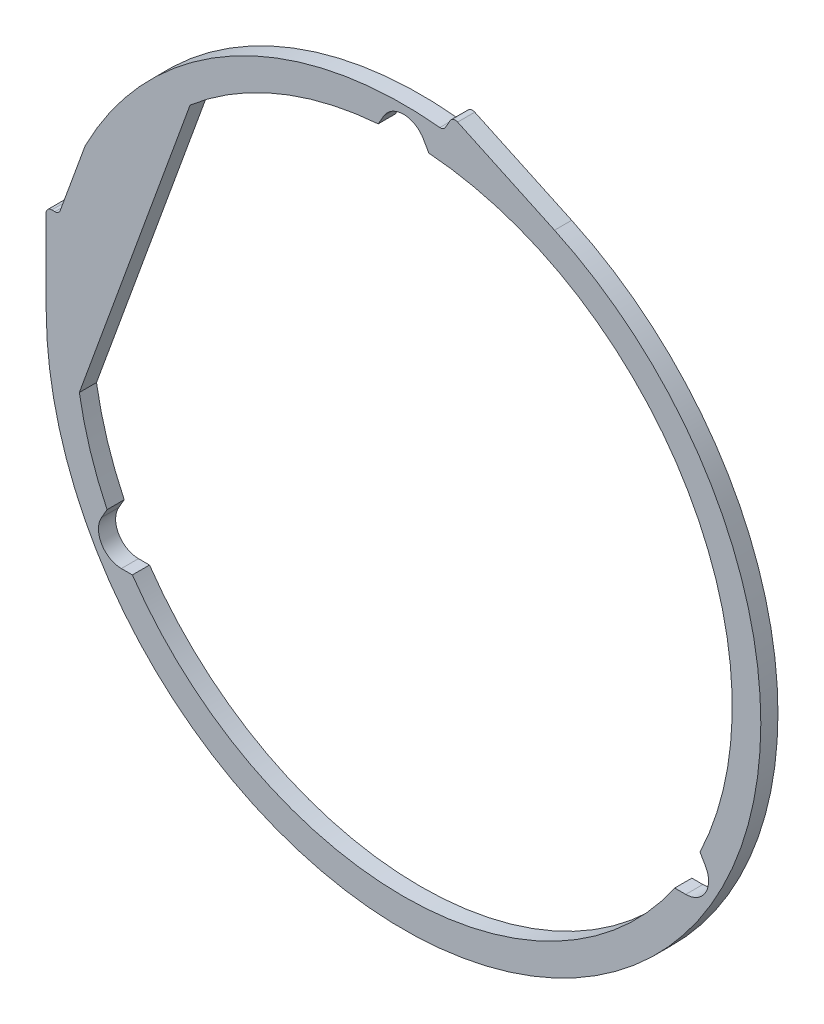
ISO-10303-21;
HEADER;
FILE_DESCRIPTION(('STEP AP214'),'2;1');
FILE_NAME('part.step','',(''),(''),'','','');
FILE_SCHEMA(('AUTOMOTIVE_DESIGN { 1 0 10303 214 1 1 1 1 }'));
ENDSEC;
DATA;
#1=APPLICATION_CONTEXT('core data for automotive mechanical design processes');
#2=APPLICATION_PROTOCOL_DEFINITION('international standard','automotive_design',2000,#1);
#3=PRODUCT_CONTEXT('',#1,'mechanical');
#4=PRODUCT('Part','Part','',(#3));
#5=PRODUCT_RELATED_PRODUCT_CATEGORY('part','',(#4));
#6=PRODUCT_DEFINITION_FORMATION('','',#4);
#7=PRODUCT_DEFINITION_CONTEXT('part definition',#1,'design');
#8=PRODUCT_DEFINITION('design','',#6,#7);
#9=PRODUCT_DEFINITION_SHAPE('','',#8);
#10=(LENGTH_UNIT() NAMED_UNIT(*) SI_UNIT(.MILLI.,.METRE.));
#11=(NAMED_UNIT(*) PLANE_ANGLE_UNIT() SI_UNIT($,.RADIAN.));
#12=(NAMED_UNIT(*) SI_UNIT($,.STERADIAN.) SOLID_ANGLE_UNIT());
#13=UNCERTAINTY_MEASURE_WITH_UNIT(LENGTH_MEASURE(1.E-05),#10,'distance_accuracy_value','');
#14=(GEOMETRIC_REPRESENTATION_CONTEXT(3) GLOBAL_UNCERTAINTY_ASSIGNED_CONTEXT((#13)) GLOBAL_UNIT_ASSIGNED_CONTEXT((#10,
#11,#12)) REPRESENTATION_CONTEXT('',''));
#15=CARTESIAN_POINT('',(0.,0.,0.));
#16=DIRECTION('',(0.,0.,1.));
#17=DIRECTION('',(1.,0.,0.));
#18=AXIS2_PLACEMENT_3D('',#15,#16,#17);
#19=CARTESIAN_POINT('',(0.,0.,-6.));
#20=DIRECTION('',(0.,0.,1.));
#21=DIRECTION('',(-1.,0.,0.));
#22=AXIS2_PLACEMENT_3D('',#19,#20,#21);
#23=CYLINDRICAL_SURFACE('',#22,115.);
#24=DIRECTION('',(0.,0.,1.));
#25=VECTOR('',#24,1.);
#26=CARTESIAN_POINT('',(8.85748634346278,114.658383625775,-6.));
#27=LINE('',#26,#25);
#28=CARTESIAN_POINT('',(8.8574863434628,114.658383625775,-6.));
#29=VERTEX_POINT('',#28);
#30=CARTESIAN_POINT('',(8.85748634346278,114.658383625775,0.));
#31=VERTEX_POINT('',#30);
#32=EDGE_CURVE('E398',#29,#31,#27,.T.);
#33=ORIENTED_EDGE('',*,*,#32,.F.);
#34=CARTESIAN_POINT('',(0.,0.,-6.));
#35=DIRECTION('',(0.,0.,1.));
#36=DIRECTION('',(-1.,0.,0.));
#37=AXIS2_PLACEMENT_3D('',#34,#35,#36);
#38=CIRCLE('',#37,115.);
#39=CARTESIAN_POINT('',(103.725816148514,-49.6583836257749,-6.));
#40=VERTEX_POINT('',#39);
#41=EDGE_CURVE('E553',#40,#29,#38,.T.);
#42=ORIENTED_EDGE('',*,*,#41,.F.);
#43=DIRECTION('',(0.,0.,1.));
#44=VECTOR('',#43,1.);
#45=CARTESIAN_POINT('',(103.725816148514,-49.6583836257749,-6.));
#46=LINE('',#45,#44);
#47=CARTESIAN_POINT('',(103.725816148514,-49.6583836257749,0.));
#48=VERTEX_POINT('',#47);
#49=EDGE_CURVE('E396',#48,#40,#46,.F.);
#50=ORIENTED_EDGE('',*,*,#49,.F.);
#51=CARTESIAN_POINT('',(0.,0.,0.));
#52=DIRECTION('',(0.,0.,1.));
#53=DIRECTION('',(-1.,0.,0.));
#54=AXIS2_PLACEMENT_3D('',#51,#52,#53);
#55=CIRCLE('',#54,115.);
#56=EDGE_CURVE('E558',#48,#31,#55,.T.);
#57=ORIENTED_EDGE('',*,*,#56,.T.);
#58=EDGE_LOOP('',(#33,#42,#50,#57));
#59=FACE_BOUND('',#58,.T.);
#60=ADVANCED_FACE('F36',(#59),#23,.F.);
#61=DIRECTION('',(0.,0.,1.));
#62=VECTOR('',#61,1.);
#63=CARTESIAN_POINT('',(94.8683298050514,-65.,-6.));
#64=LINE('',#63,#62);
#65=CARTESIAN_POINT('',(94.8683298050514,-65.,-6.));
#66=VERTEX_POINT('',#65);
#67=CARTESIAN_POINT('',(94.8683298050514,-65.,0.));
#68=VERTEX_POINT('',#67);
#69=EDGE_CURVE('E394',#66,#68,#64,.T.);
#70=ORIENTED_EDGE('',*,*,#69,.F.);
#71=CARTESIAN_POINT('',(-94.8683298050514,-65.0000000000001,-6.));
#72=VERTEX_POINT('',#71);
#73=EDGE_CURVE('E281',#72,#66,#38,.T.);
#74=ORIENTED_EDGE('',*,*,#73,.F.);
#75=DIRECTION('',(0.,0.,1.));
#76=VECTOR('',#75,1.);
#77=CARTESIAN_POINT('',(-94.8683298050514,-65.0000000000001,-6.));
#78=LINE('',#77,#76);
#79=CARTESIAN_POINT('',(-94.8683298050514,-65.0000000000001,0.));
#80=VERTEX_POINT('',#79);
#81=EDGE_CURVE('E392',#80,#72,#78,.F.);
#82=ORIENTED_EDGE('',*,*,#81,.F.);
#83=EDGE_CURVE('E288',#80,#68,#55,.T.);
#84=ORIENTED_EDGE('',*,*,#83,.T.);
#85=EDGE_LOOP('',(#70,#74,#82,#84));
#86=FACE_BOUND('',#85,.T.);
#87=ADVANCED_FACE('F434',(#86),#23,.F.);
#88=DIRECTION('',(0.,0.,1.));
#89=VECTOR('',#88,1.);
#90=CARTESIAN_POINT('',(-103.725816148514,-49.6583836257749,-6.));
#91=LINE('',#90,#89);
#92=CARTESIAN_POINT('',(-103.725816148514,-49.6583836257749,-6.));
#93=VERTEX_POINT('',#92);
#94=CARTESIAN_POINT('',(-103.725816148514,-49.6583836257749,0.));
#95=VERTEX_POINT('',#94);
#96=EDGE_CURVE('E390',#93,#95,#91,.T.);
#97=ORIENTED_EDGE('',*,*,#96,.F.);
#98=CARTESIAN_POINT('',(-113.419575030063,-19.,-6.));
#99=VERTEX_POINT('',#98);
#100=EDGE_CURVE('E277',#99,#93,#38,.T.);
#101=ORIENTED_EDGE('',*,*,#100,.F.);
#102=DIRECTION('',(0.,0.,1.));
#103=VECTOR('',#102,1.);
#104=CARTESIAN_POINT('',(-113.419575030063,-19.,-6.));
#105=LINE('',#104,#103);
#106=CARTESIAN_POINT('',(-113.419575030063,-19.,0.));
#107=VERTEX_POINT('',#106);
#108=EDGE_CURVE('E291',#99,#107,#105,.T.);
#109=ORIENTED_EDGE('',*,*,#108,.T.);
#110=EDGE_CURVE('E276',#107,#95,#55,.T.);
#111=ORIENTED_EDGE('',*,*,#110,.T.);
#112=EDGE_LOOP('',(#97,#101,#109,#111));
#113=FACE_BOUND('',#112,.T.);
#114=ADVANCED_FACE('F419',(#113),#23,.F.);
#115=CARTESIAN_POINT('',(0.,0.,-6.));
#116=DIRECTION('',(0.,0.,-1.));
#117=DIRECTION('',(1.,0.,0.));
#118=AXIS2_PLACEMENT_3D('',#115,#116,#117);
#119=PLANE('',#118);
#120=DIRECTION('',(-0.5,0.866025403784439,0.));
#121=VECTOR('',#120,1.);
#122=CARTESIAN_POINT('',(105.655099261702,-53.,-6.));
#123=LINE('',#122,#121);
#124=CARTESIAN_POINT('',(105.655099261702,-53.,-6.));
#125=VERTEX_POINT('',#124);
#126=EDGE_CURVE('E221',#125,#40,#123,.T.);
#127=ORIENTED_EDGE('',*,*,#126,.T.);
#128=ORIENTED_EDGE('',*,*,#41,.T.);
#129=CARTESIAN_POINT('',(6.9282032302755,118.,-6.));
#130=VERTEX_POINT('',#129);
#131=EDGE_CURVE('E236',#29,#130,#123,.T.);
#132=ORIENTED_EDGE('',*,*,#131,.T.);
#133=CARTESIAN_POINT('',(0.,114.,-6.));
#134=DIRECTION('',(0.,0.,1.));
#135=DIRECTION('',(1.,0.,0.));
#136=AXIS2_PLACEMENT_3D('',#133,#134,#135);
#137=CIRCLE('',#136,8.);
#138=CARTESIAN_POINT('',(-6.92820323027552,118.,-6.));
#139=VERTEX_POINT('',#138);
#140=EDGE_CURVE('E214',#130,#139,#137,.T.);
#141=ORIENTED_EDGE('',*,*,#140,.T.);
#142=DIRECTION('',(-0.5,-0.866025403784439,0.));
#143=VECTOR('',#142,1.);
#144=CARTESIAN_POINT('',(-6.92820323027552,118.,-6.));
#145=LINE('',#144,#143);
#146=CARTESIAN_POINT('',(-8.85748634346283,114.658383625775,-6.));
#147=VERTEX_POINT('',#146);
#148=EDGE_CURVE('E224',#139,#147,#145,.T.);
#149=ORIENTED_EDGE('',*,*,#148,.T.);
#150=CARTESIAN_POINT('',(-74.6714706086505,87.4595419444982,-6.));
#151=VERTEX_POINT('',#150);
#152=EDGE_CURVE('E275',#147,#151,#38,.T.);
#153=ORIENTED_EDGE('',*,*,#152,.T.);
#154=DIRECTION('',(-0.342020143325672,-0.939692620785907,0.));
#155=VECTOR('',#154,1.);
#156=CARTESIAN_POINT('',(-83.9036139442699,62.0944365967156,-6.));
#157=LINE('',#156,#155);
#158=EDGE_CURVE('E272',#151,#99,#157,.T.);
#159=ORIENTED_EDGE('',*,*,#158,.T.);
#160=ORIENTED_EDGE('',*,*,#100,.T.);
#161=CARTESIAN_POINT('',(-105.655099261702,-53.0000000000001,-6.));
#162=VERTEX_POINT('',#161);
#163=EDGE_CURVE('E59',#93,#162,#145,.T.);
#164=ORIENTED_EDGE('',*,*,#163,.T.);
#165=CARTESIAN_POINT('',(-98.7268960314261,-57.0000000000001,-6.));
#166=DIRECTION('',(0.,0.,1.));
#167=DIRECTION('',(-1.,0.,0.));
#168=AXIS2_PLACEMENT_3D('',#165,#166,#167);
#169=CIRCLE('',#168,7.99999999999999);
#170=CARTESIAN_POINT('',(-98.7268960314261,-65.0000000000001,-6.));
#171=VERTEX_POINT('',#170);
#172=EDGE_CURVE('E230',#162,#171,#169,.T.);
#173=ORIENTED_EDGE('',*,*,#172,.T.);
#174=DIRECTION('',(1.,0.,0.));
#175=VECTOR('',#174,1.);
#176=CARTESIAN_POINT('',(-98.7268960314261,-65.0000000000001,-6.));
#177=LINE('',#176,#175);
#178=EDGE_CURVE('E241',#171,#72,#177,.T.);
#179=ORIENTED_EDGE('',*,*,#178,.T.);
#180=ORIENTED_EDGE('',*,*,#73,.T.);
#181=CARTESIAN_POINT('',(98.726896031426,-65.,-6.));
#182=VERTEX_POINT('',#181);
#183=EDGE_CURVE('E51',#66,#182,#177,.T.);
#184=ORIENTED_EDGE('',*,*,#183,.T.);
#185=CARTESIAN_POINT('',(98.726896031426,-57.,-6.));
#186=DIRECTION('',(0.,0.,1.));
#187=DIRECTION('',(1.,0.,0.));
#188=AXIS2_PLACEMENT_3D('',#185,#186,#187);
#189=CIRCLE('',#188,8.00000000000001);
#190=EDGE_CURVE('E244',#182,#125,#189,.T.);
#191=ORIENTED_EDGE('',*,*,#190,.T.);
#192=EDGE_LOOP('',(#127,#128,#132,#141,#149,#153,#159,#160,#164,#173,#179,#180,#184,#191));
#193=FACE_BOUND('',#192,.T.);
#194=CARTESIAN_POINT('',(0.,0.,-6.));
#195=DIRECTION('',(0.,0.,1.));
#196=DIRECTION('',(1.,0.,0.));
#197=AXIS2_PLACEMENT_3D('',#194,#195,#196);
#198=CIRCLE('',#197,125.);
#199=CARTESIAN_POINT('',(12.7155638171814,124.351575932158,-6.));
#200=VERTEX_POINT('',#199);
#201=CARTESIAN_POINT('',(-111.368165093256,56.7638247809404,-6.));
#202=VERTEX_POINT('',#201);
#203=EDGE_CURVE('E313',#200,#202,#198,.T.);
#204=ORIENTED_EDGE('',*,*,#203,.F.);
#205=CARTESIAN_POINT('',(12.9190128382563,126.341201147072,-6.));
#206=DIRECTION('',(0.,0.,1.));
#207=DIRECTION('',(1.,0.,0.));
#208=AXIS2_PLACEMENT_3D('',#205,#206,#207);
#209=CIRCLE('',#208,2.);
#210=CARTESIAN_POINT('',(14.6510636458252,125.341201147072,-6.));
#211=VERTEX_POINT('',#210);
#212=EDGE_CURVE('E380',#211,#200,#209,.F.);
#213=ORIENTED_EDGE('',*,*,#212,.F.);
#214=DIRECTION('',(-0.500000000000004,-0.866025403784436,0.));
#215=VECTOR('',#214,1.);
#216=CARTESIAN_POINT('',(14.,124.213525833542,-6.));
#217=LINE('',#216,#215);
#218=CARTESIAN_POINT('',(16.349927234042,128.283719196993,-6.));
#219=VERTEX_POINT('',#218);
#220=EDGE_CURVE('E310',#219,#211,#217,.T.);
#221=ORIENTED_EDGE('',*,*,#220,.F.);
#222=CARTESIAN_POINT('',(18.0819780416109,127.283719196993,-6.));
#223=DIRECTION('',(0.,0.,1.));
#224=DIRECTION('',(1.,0.,0.));
#225=AXIS2_PLACEMENT_3D('',#222,#223,#224);
#226=CIRCLE('',#225,2.);
#227=CARTESIAN_POINT('',(18.9272145650923,129.096334771066,-6.));
#228=VERTEX_POINT('',#227);
#229=EDGE_CURVE('E359',#228,#219,#226,.T.);
#230=ORIENTED_EDGE('',*,*,#229,.F.);
#231=DIRECTION('',(-0.906307787036653,0.422618261740693,0.));
#232=VECTOR('',#231,1.);
#233=CARTESIAN_POINT('',(52.8272827175867,113.288473379582,-6.));
#234=LINE('',#233,#232);
#235=CARTESIAN_POINT('',(52.8272827175867,113.288473379582,-6.));
#236=VERTEX_POINT('',#235);
#237=EDGE_CURVE('E307',#236,#228,#234,.T.);
#238=ORIENTED_EDGE('',*,*,#237,.F.);
#239=CARTESIAN_POINT('',(0.,0.,-6.));
#240=DIRECTION('',(0.,0.,1.));
#241=DIRECTION('',(-1.,0.,0.));
#242=AXIS2_PLACEMENT_3D('',#239,#240,#241);
#243=CIRCLE('',#242,125.);
#244=CARTESIAN_POINT('',(-124.999607369247,-0.313301028025067,-6.));
#245=VERTEX_POINT('',#244);
#246=EDGE_CURVE('E304',#245,#236,#243,.T.);
#247=ORIENTED_EDGE('',*,*,#246,.F.);
#248=DIRECTION('',(0.00250640822420055,-0.999996858953974,0.));
#249=VECTOR('',#248,1.);
#250=CARTESIAN_POINT('',(-125.079344739041,31.5,-6.));
#251=LINE('',#250,#249);
#252=CARTESIAN_POINT('',(-125.074319342643,29.4949871835516,-6.));
#253=VERTEX_POINT('',#252);
#254=EDGE_CURVE('E301',#253,#245,#251,.T.);
#255=ORIENTED_EDGE('',*,*,#254,.F.);
#256=CARTESIAN_POINT('',(-123.074325624735,29.5,-6.));
#257=DIRECTION('',(0.,0.,1.));
#258=DIRECTION('',(1.,0.,0.));
#259=AXIS2_PLACEMENT_3D('',#256,#257,#258);
#260=CIRCLE('',#259,2.);
#261=CARTESIAN_POINT('',(-123.074325624735,31.5,-6.));
#262=VERTEX_POINT('',#261);
#263=EDGE_CURVE('E356',#262,#253,#260,.T.);
#264=ORIENTED_EDGE('',*,*,#263,.F.);
#265=DIRECTION('',(-1.,0.,0.));
#266=VECTOR('',#265,1.);
#267=CARTESIAN_POINT('',(-120.579344739041,31.5,-6.));
#268=LINE('',#267,#266);
#269=CARTESIAN_POINT('',(-121.97975981546,31.5,-6.));
#270=VERTEX_POINT('',#269);
#271=EDGE_CURVE('E297',#270,#262,#268,.T.);
#272=ORIENTED_EDGE('',*,*,#271,.F.);
#273=CARTESIAN_POINT('',(-121.97975981546,33.5,-6.));
#274=DIRECTION('',(0.,0.,1.));
#275=DIRECTION('',(1.,0.,0.));
#276=AXIS2_PLACEMENT_3D('',#273,#274,#275);
#277=CIRCLE('',#276,2.);
#278=CARTESIAN_POINT('',(-120.100374573889,32.8159597133486,-6.));
#279=VERTEX_POINT('',#278);
#280=EDGE_CURVE('E386',#279,#270,#277,.F.);
#281=ORIENTED_EDGE('',*,*,#280,.F.);
#282=DIRECTION('',(-0.342020143325671,-0.939692620785907,0.));
#283=VECTOR('',#282,1.);
#284=CARTESIAN_POINT('',(-120.579344739041,31.5,-6.));
#285=LINE('',#284,#283);
#286=CARTESIAN_POINT('',(-111.465659693336,56.5396438710967,-6.));
#287=VERTEX_POINT('',#286);
#288=EDGE_CURVE('E294',#287,#279,#285,.T.);
#289=ORIENTED_EDGE('',*,*,#288,.F.);
#290=CARTESIAN_POINT('',(-109.586274451764,55.8556035844453,-6.));
#291=DIRECTION('',(0.,0.,1.));
#292=DIRECTION('',(1.,0.,0.));
#293=AXIS2_PLACEMENT_3D('',#290,#291,#292);
#294=CIRCLE('',#293,2.);
#295=EDGE_CURVE('E362',#202,#287,#294,.T.);
#296=ORIENTED_EDGE('',*,*,#295,.F.);
#297=EDGE_LOOP('',(#204,#213,#221,#230,#238,#247,#255,#264,#272,#281,#289,#296));
#298=FACE_BOUND('',#297,.T.);
#299=ADVANCED_FACE('F233',(#193,#298),#119,.T.);
#300=CARTESIAN_POINT('',(0.,0.,0.));
#301=DIRECTION('',(0.,0.,-1.));
#302=DIRECTION('',(1.,0.,0.));
#303=AXIS2_PLACEMENT_3D('',#300,#301,#302);
#304=PLANE('',#303);
#305=DIRECTION('',(-0.342020143325671,-0.939692620785907,0.));
#306=VECTOR('',#305,1.);
#307=CARTESIAN_POINT('',(-120.579344739041,31.5,0.));
#308=LINE('',#307,#306);
#309=CARTESIAN_POINT('',(-111.465659693336,56.5396438710967,0.));
#310=VERTEX_POINT('',#309);
#311=CARTESIAN_POINT('',(-120.100374573889,32.8159597133486,0.));
#312=VERTEX_POINT('',#311);
#313=EDGE_CURVE('E293',#310,#312,#308,.T.);
#314=ORIENTED_EDGE('',*,*,#313,.T.);
#315=CARTESIAN_POINT('',(-121.97975981546,33.5,0.));
#316=DIRECTION('',(0.,0.,1.));
#317=DIRECTION('',(1.,0.,0.));
#318=AXIS2_PLACEMENT_3D('',#315,#316,#317);
#319=CIRCLE('',#318,2.);
#320=CARTESIAN_POINT('',(-121.97975981546,31.5,0.));
#321=VERTEX_POINT('',#320);
#322=EDGE_CURVE('E383',#321,#312,#319,.T.);
#323=ORIENTED_EDGE('',*,*,#322,.F.);
#324=DIRECTION('',(-1.,0.,0.));
#325=VECTOR('',#324,1.);
#326=CARTESIAN_POINT('',(-120.579344739041,31.5,0.));
#327=LINE('',#326,#325);
#328=CARTESIAN_POINT('',(-123.074325624735,31.5,0.));
#329=VERTEX_POINT('',#328);
#330=EDGE_CURVE('E319',#321,#329,#327,.T.);
#331=ORIENTED_EDGE('',*,*,#330,.T.);
#332=CARTESIAN_POINT('',(-123.074325624735,29.5,0.));
#333=DIRECTION('',(0.,0.,1.));
#334=DIRECTION('',(1.,0.,0.));
#335=AXIS2_PLACEMENT_3D('',#332,#333,#334);
#336=CIRCLE('',#335,2.);
#337=CARTESIAN_POINT('',(-125.074319342643,29.4949871835516,0.));
#338=VERTEX_POINT('',#337);
#339=EDGE_CURVE('E343',#338,#329,#336,.F.);
#340=ORIENTED_EDGE('',*,*,#339,.F.);
#341=DIRECTION('',(0.00250640822420055,-0.999996858953974,0.));
#342=VECTOR('',#341,1.);
#343=CARTESIAN_POINT('',(-125.079344739041,31.5,0.));
#344=LINE('',#343,#342);
#345=CARTESIAN_POINT('',(-124.999607369247,-0.313301028025067,0.));
#346=VERTEX_POINT('',#345);
#347=EDGE_CURVE('E322',#338,#346,#344,.T.);
#348=ORIENTED_EDGE('',*,*,#347,.T.);
#349=CARTESIAN_POINT('',(0.,0.,0.));
#350=DIRECTION('',(0.,0.,1.));
#351=DIRECTION('',(-1.,0.,0.));
#352=AXIS2_PLACEMENT_3D('',#349,#350,#351);
#353=CIRCLE('',#352,125.);
#354=CARTESIAN_POINT('',(52.8272827175867,113.288473379582,0.));
#355=VERTEX_POINT('',#354);
#356=EDGE_CURVE('E325',#346,#355,#353,.T.);
#357=ORIENTED_EDGE('',*,*,#356,.T.);
#358=DIRECTION('',(-0.906307787036653,0.422618261740693,0.));
#359=VECTOR('',#358,1.);
#360=CARTESIAN_POINT('',(52.8272827175867,113.288473379582,0.));
#361=LINE('',#360,#359);
#362=CARTESIAN_POINT('',(18.9272145650923,129.096334771066,0.));
#363=VERTEX_POINT('',#362);
#364=EDGE_CURVE('E328',#355,#363,#361,.T.);
#365=ORIENTED_EDGE('',*,*,#364,.T.);
#366=CARTESIAN_POINT('',(18.0819780416109,127.283719196993,0.));
#367=DIRECTION('',(0.,0.,1.));
#368=DIRECTION('',(1.,0.,0.));
#369=AXIS2_PLACEMENT_3D('',#366,#367,#368);
#370=CIRCLE('',#369,2.);
#371=CARTESIAN_POINT('',(16.349927234042,128.283719196993,0.));
#372=VERTEX_POINT('',#371);
#373=EDGE_CURVE('E346',#372,#363,#370,.F.);
#374=ORIENTED_EDGE('',*,*,#373,.F.);
#375=DIRECTION('',(-0.500000000000004,-0.866025403784436,0.));
#376=VECTOR('',#375,1.);
#377=CARTESIAN_POINT('',(14.,124.213525833542,0.));
#378=LINE('',#377,#376);
#379=CARTESIAN_POINT('',(14.6510636458252,125.341201147072,0.));
#380=VERTEX_POINT('',#379);
#381=EDGE_CURVE('E331',#372,#380,#378,.T.);
#382=ORIENTED_EDGE('',*,*,#381,.T.);
#383=CARTESIAN_POINT('',(12.9190128382563,126.341201147072,0.));
#384=DIRECTION('',(0.,0.,1.));
#385=DIRECTION('',(1.,0.,0.));
#386=AXIS2_PLACEMENT_3D('',#383,#384,#385);
#387=CIRCLE('',#386,2.);
#388=CARTESIAN_POINT('',(12.7155638171814,124.351575932158,0.));
#389=VERTEX_POINT('',#388);
#390=EDGE_CURVE('E377',#389,#380,#387,.T.);
#391=ORIENTED_EDGE('',*,*,#390,.F.);
#392=CARTESIAN_POINT('',(0.,0.,0.));
#393=DIRECTION('',(0.,0.,1.));
#394=DIRECTION('',(1.,0.,0.));
#395=AXIS2_PLACEMENT_3D('',#392,#393,#394);
#396=CIRCLE('',#395,125.);
#397=CARTESIAN_POINT('',(-111.368165093256,56.7638247809404,0.));
#398=VERTEX_POINT('',#397);
#399=EDGE_CURVE('E298',#389,#398,#396,.T.);
#400=ORIENTED_EDGE('',*,*,#399,.T.);
#401=CARTESIAN_POINT('',(-109.586274451764,55.8556035844453,0.));
#402=DIRECTION('',(0.,0.,1.));
#403=DIRECTION('',(1.,0.,0.));
#404=AXIS2_PLACEMENT_3D('',#401,#402,#403);
#405=CIRCLE('',#404,2.);
#406=EDGE_CURVE('E349',#310,#398,#405,.F.);
#407=ORIENTED_EDGE('',*,*,#406,.F.);
#408=EDGE_LOOP('',(#314,#323,#331,#340,#348,#357,#365,#374,#382,#391,#400,#407));
#409=FACE_BOUND('',#408,.T.);
#410=ORIENTED_EDGE('',*,*,#56,.F.);
#411=DIRECTION('',(0.5,-0.866025403784439,0.));
#412=VECTOR('',#411,1.);
#413=CARTESIAN_POINT('',(56.2916512459885,32.5,0.));
#414=LINE('',#413,#412);
#415=CARTESIAN_POINT('',(105.655099261702,-53.,0.));
#416=VERTEX_POINT('',#415);
#417=EDGE_CURVE('E268',#48,#416,#414,.T.);
#418=ORIENTED_EDGE('',*,*,#417,.T.);
#419=CARTESIAN_POINT('',(98.726896031426,-57.,0.));
#420=DIRECTION('',(0.,0.,-1.));
#421=DIRECTION('',(-1.,0.,0.));
#422=AXIS2_PLACEMENT_3D('',#419,#420,#421);
#423=CIRCLE('',#422,8.00000000000001);
#424=CARTESIAN_POINT('',(98.726896031426,-65.,0.));
#425=VERTEX_POINT('',#424);
#426=EDGE_CURVE('E11',#416,#425,#423,.T.);
#427=ORIENTED_EDGE('',*,*,#426,.T.);
#428=DIRECTION('',(-1.,0.,0.));
#429=VECTOR('',#428,1.);
#430=CARTESIAN_POINT('',(0.,-65.0000000000001,0.));
#431=LINE('',#430,#429);
#432=EDGE_CURVE('E267',#425,#68,#431,.T.);
#433=ORIENTED_EDGE('',*,*,#432,.T.);
#434=ORIENTED_EDGE('',*,*,#83,.F.);
#435=CARTESIAN_POINT('',(-98.7268960314261,-65.0000000000001,0.));
#436=VERTEX_POINT('',#435);
#437=EDGE_CURVE('E264',#80,#436,#431,.T.);
#438=ORIENTED_EDGE('',*,*,#437,.T.);
#439=CARTESIAN_POINT('',(-98.7268960314261,-57.0000000000001,0.));
#440=DIRECTION('',(0.,0.,-1.));
#441=DIRECTION('',(-1.,0.,0.));
#442=AXIS2_PLACEMENT_3D('',#439,#440,#441);
#443=CIRCLE('',#442,7.99999999999999);
#444=CARTESIAN_POINT('',(-105.655099261702,-53.0000000000001,0.));
#445=VERTEX_POINT('',#444);
#446=EDGE_CURVE('E44',#436,#445,#443,.T.);
#447=ORIENTED_EDGE('',*,*,#446,.T.);
#448=DIRECTION('',(0.5,0.866025403784439,0.));
#449=VECTOR('',#448,1.);
#450=CARTESIAN_POINT('',(-56.2916512459885,32.5,0.));
#451=LINE('',#450,#449);
#452=EDGE_CURVE('E263',#445,#95,#451,.T.);
#453=ORIENTED_EDGE('',*,*,#452,.T.);
#454=ORIENTED_EDGE('',*,*,#110,.F.);
#455=DIRECTION('',(-0.342020143325673,-0.939692620785907,0.));
#456=VECTOR('',#455,1.);
#457=CARTESIAN_POINT('',(-83.9036139442699,62.0944365967156,0.));
#458=LINE('',#457,#456);
#459=CARTESIAN_POINT('',(-74.6714706086505,87.4595419444982,0.));
#460=VERTEX_POINT('',#459);
#461=EDGE_CURVE('E282',#460,#107,#458,.T.);
#462=ORIENTED_EDGE('',*,*,#461,.F.);
#463=CARTESIAN_POINT('',(-8.85748634346284,114.658383625775,0.));
#464=VERTEX_POINT('',#463);
#465=EDGE_CURVE('E285',#464,#460,#55,.T.);
#466=ORIENTED_EDGE('',*,*,#465,.F.);
#467=CARTESIAN_POINT('',(-6.92820323027552,118.,0.));
#468=VERTEX_POINT('',#467);
#469=EDGE_CURVE('E250',#464,#468,#451,.T.);
#470=ORIENTED_EDGE('',*,*,#469,.T.);
#471=CARTESIAN_POINT('',(0.,114.,0.));
#472=DIRECTION('',(0.,0.,-1.));
#473=DIRECTION('',(-1.,0.,0.));
#474=AXIS2_PLACEMENT_3D('',#471,#472,#473);
#475=CIRCLE('',#474,8.);
#476=CARTESIAN_POINT('',(6.9282032302755,118.,0.));
#477=VERTEX_POINT('',#476);
#478=EDGE_CURVE('E217',#468,#477,#475,.T.);
#479=ORIENTED_EDGE('',*,*,#478,.T.);
#480=EDGE_CURVE('E271',#477,#31,#414,.T.);
#481=ORIENTED_EDGE('',*,*,#480,.T.);
#482=EDGE_LOOP('',(#410,#418,#427,#433,#434,#438,#447,#453,#454,#462,#466,#470,#479,#481));
#483=FACE_BOUND('',#482,.T.);
#484=ADVANCED_FACE('F404',(#409,#483),#304,.F.);
#485=CARTESIAN_POINT('',(-120.579344739041,31.5,-6.));
#486=DIRECTION('',(0.939692620785907,-0.342020143325671,0.));
#487=DIRECTION('',(0.342020143325672,0.939692620785908,0.));
#488=AXIS2_PLACEMENT_3D('',#485,#486,#487);
#489=PLANE('',#488);
#490=ORIENTED_EDGE('',*,*,#288,.T.);
#491=DIRECTION('',(0.,0.,1.));
#492=VECTOR('',#491,1.);
#493=CARTESIAN_POINT('',(-120.100374573889,32.8159597133486,-6.));
#494=LINE('',#493,#492);
#495=EDGE_CURVE('E339',#312,#279,#494,.F.);
#496=ORIENTED_EDGE('',*,*,#495,.F.);
#497=ORIENTED_EDGE('',*,*,#313,.F.);
#498=DIRECTION('',(0.,0.,1.));
#499=VECTOR('',#498,1.);
#500=CARTESIAN_POINT('',(-111.465659693336,56.5396438710967,-6.));
#501=LINE('',#500,#499);
#502=EDGE_CURVE('E341',#287,#310,#501,.T.);
#503=ORIENTED_EDGE('',*,*,#502,.F.);
#504=EDGE_LOOP('',(#490,#496,#497,#503));
#505=FACE_BOUND('',#504,.T.);
#506=ADVANCED_FACE('F465',(#505),#489,.F.);
#507=CARTESIAN_POINT('',(-120.579344739041,31.5,-6.));
#508=DIRECTION('',(0.,-1.,0.));
#509=DIRECTION('',(1.,0.,0.));
#510=AXIS2_PLACEMENT_3D('',#507,#508,#509);
#511=PLANE('',#510);
#512=ORIENTED_EDGE('',*,*,#271,.T.);
#513=DIRECTION('',(0.,0.,1.));
#514=VECTOR('',#513,1.);
#515=CARTESIAN_POINT('',(-123.074325624735,31.5,-6.));
#516=LINE('',#515,#514);
#517=EDGE_CURVE('E371',#329,#262,#516,.F.);
#518=ORIENTED_EDGE('',*,*,#517,.F.);
#519=ORIENTED_EDGE('',*,*,#330,.F.);
#520=DIRECTION('',(0.,0.,1.));
#521=VECTOR('',#520,1.);
#522=CARTESIAN_POINT('',(-121.97975981546,31.5,0.));
#523=LINE('',#522,#521);
#524=EDGE_CURVE('E373',#270,#321,#523,.T.);
#525=ORIENTED_EDGE('',*,*,#524,.F.);
#526=EDGE_LOOP('',(#512,#518,#519,#525));
#527=FACE_BOUND('',#526,.T.);
#528=ADVANCED_FACE('F487',(#527),#511,.F.);
#529=CARTESIAN_POINT('',(-125.079344739041,31.5,-6.));
#530=DIRECTION('',(0.999996858953974,0.00250640822420055,0.));
#531=DIRECTION('',(-0.00250640822420055,0.999996858953974,0.));
#532=AXIS2_PLACEMENT_3D('',#529,#530,#531);
#533=PLANE('',#532);
#534=ORIENTED_EDGE('',*,*,#254,.T.);
#535=DIRECTION('',(0.,0.,1.));
#536=VECTOR('',#535,1.);
#537=CARTESIAN_POINT('',(-124.999607369247,-0.313301028025067,-6.));
#538=LINE('',#537,#536);
#539=EDGE_CURVE('E337',#245,#346,#538,.T.);
#540=ORIENTED_EDGE('',*,*,#539,.T.);
#541=ORIENTED_EDGE('',*,*,#347,.F.);
#542=DIRECTION('',(0.,0.,1.));
#543=VECTOR('',#542,1.);
#544=CARTESIAN_POINT('',(-125.074319342643,29.4949871835516,-6.));
#545=LINE('',#544,#543);
#546=EDGE_CURVE('E375',#253,#338,#545,.T.);
#547=ORIENTED_EDGE('',*,*,#546,.F.);
#548=EDGE_LOOP('',(#534,#540,#541,#547));
#549=FACE_BOUND('',#548,.T.);
#550=ADVANCED_FACE('F483',(#549),#533,.F.);
#551=CARTESIAN_POINT('',(0.,0.,-6.));
#552=DIRECTION('',(0.,0.,1.));
#553=DIRECTION('',(-1.,0.,0.));
#554=AXIS2_PLACEMENT_3D('',#551,#552,#553);
#555=CYLINDRICAL_SURFACE('',#554,125.);
#556=ORIENTED_EDGE('',*,*,#356,.F.);
#557=ORIENTED_EDGE('',*,*,#539,.F.);
#558=ORIENTED_EDGE('',*,*,#246,.T.);
#559=DIRECTION('',(0.,0.,1.));
#560=VECTOR('',#559,1.);
#561=CARTESIAN_POINT('',(52.8272827175867,113.288473379582,-6.));
#562=LINE('',#561,#560);
#563=EDGE_CURVE('E316',#236,#355,#562,.T.);
#564=ORIENTED_EDGE('',*,*,#563,.T.);
#565=EDGE_LOOP('',(#556,#557,#558,#564));
#566=FACE_BOUND('',#565,.T.);
#567=ADVANCED_FACE('F479',(#566),#555,.T.);
#568=CARTESIAN_POINT('',(52.8272827175867,113.288473379582,-6.));
#569=DIRECTION('',(-0.422618261740693,-0.906307787036653,0.));
#570=DIRECTION('',(0.906307787036653,-0.422618261740693,0.));
#571=AXIS2_PLACEMENT_3D('',#568,#569,#570);
#572=PLANE('',#571);
#573=ORIENTED_EDGE('',*,*,#364,.F.);
#574=ORIENTED_EDGE('',*,*,#563,.F.);
#575=ORIENTED_EDGE('',*,*,#237,.T.);
#576=DIRECTION('',(0.,0.,1.));
#577=VECTOR('',#576,1.);
#578=CARTESIAN_POINT('',(18.9272145650923,129.096334771066,-6.));
#579=LINE('',#578,#577);
#580=EDGE_CURVE('E369',#363,#228,#579,.F.);
#581=ORIENTED_EDGE('',*,*,#580,.F.);
#582=EDGE_LOOP('',(#573,#574,#575,#581));
#583=FACE_BOUND('',#582,.T.);
#584=ADVANCED_FACE('F475',(#583),#572,.F.);
#585=CARTESIAN_POINT('',(14.,124.213525833542,-6.));
#586=DIRECTION('',(0.866025403784436,-0.500000000000004,0.));
#587=DIRECTION('',(0.500000000000004,0.866025403784437,0.));
#588=AXIS2_PLACEMENT_3D('',#585,#586,#587);
#589=PLANE('',#588);
#590=ORIENTED_EDGE('',*,*,#381,.F.);
#591=DIRECTION('',(0.,0.,1.));
#592=VECTOR('',#591,1.);
#593=CARTESIAN_POINT('',(16.349927234042,128.283719196993,-6.));
#594=LINE('',#593,#592);
#595=EDGE_CURVE('E365',#219,#372,#594,.T.);
#596=ORIENTED_EDGE('',*,*,#595,.F.);
#597=ORIENTED_EDGE('',*,*,#220,.T.);
#598=DIRECTION('',(0.,0.,-1.));
#599=VECTOR('',#598,1.);
#600=CARTESIAN_POINT('',(14.6510636458252,125.341201147072,-6.));
#601=LINE('',#600,#599);
#602=EDGE_CURVE('E367',#380,#211,#601,.T.);
#603=ORIENTED_EDGE('',*,*,#602,.F.);
#604=EDGE_LOOP('',(#590,#596,#597,#603));
#605=FACE_BOUND('',#604,.T.);
#606=ADVANCED_FACE('F471',(#605),#589,.F.);
#607=CARTESIAN_POINT('',(0.,0.,-6.));
#608=DIRECTION('',(0.,0.,1.));
#609=DIRECTION('',(-1.,0.,0.));
#610=AXIS2_PLACEMENT_3D('',#607,#608,#609);
#611=CYLINDRICAL_SURFACE('',#610,125.);
#612=ORIENTED_EDGE('',*,*,#399,.F.);
#613=DIRECTION('',(0.,0.,1.));
#614=VECTOR('',#613,1.);
#615=CARTESIAN_POINT('',(12.7155638171814,124.351575932158,-6.));
#616=LINE('',#615,#614);
#617=EDGE_CURVE('E352',#200,#389,#616,.T.);
#618=ORIENTED_EDGE('',*,*,#617,.F.);
#619=ORIENTED_EDGE('',*,*,#203,.T.);
#620=DIRECTION('',(0.,0.,1.));
#621=VECTOR('',#620,1.);
#622=CARTESIAN_POINT('',(-111.368165093256,56.7638247809404,-6.));
#623=LINE('',#622,#621);
#624=EDGE_CURVE('E354',#398,#202,#623,.F.);
#625=ORIENTED_EDGE('',*,*,#624,.F.);
#626=EDGE_LOOP('',(#612,#618,#619,#625));
#627=FACE_BOUND('',#626,.T.);
#628=ADVANCED_FACE('F455',(#627),#611,.T.);
#629=CARTESIAN_POINT('',(-83.9036139442699,62.0944365967156,-6.));
#630=DIRECTION('',(0.939692620785907,-0.342020143325673,0.));
#631=DIRECTION('',(0.342020143325673,0.939692620785907,0.));
#632=AXIS2_PLACEMENT_3D('',#629,#630,#631);
#633=PLANE('',#632);
#634=ORIENTED_EDGE('',*,*,#461,.T.);
#635=ORIENTED_EDGE('',*,*,#108,.F.);
#636=ORIENTED_EDGE('',*,*,#158,.F.);
#637=DIRECTION('',(0.,0.,1.));
#638=VECTOR('',#637,1.);
#639=CARTESIAN_POINT('',(-74.6714706086505,87.4595419444982,-6.));
#640=LINE('',#639,#638);
#641=EDGE_CURVE('E280',#151,#460,#640,.T.);
#642=ORIENTED_EDGE('',*,*,#641,.T.);
#643=EDGE_LOOP('',(#634,#635,#636,#642));
#644=FACE_BOUND('',#643,.T.);
#645=ADVANCED_FACE('F446',(#644),#633,.T.);
#646=DIRECTION('',(0.,0.,1.));
#647=VECTOR('',#646,1.);
#648=CARTESIAN_POINT('',(-8.85748634346284,114.658383625775,-6.));
#649=LINE('',#648,#647);
#650=EDGE_CURVE('E227',#464,#147,#649,.F.);
#651=ORIENTED_EDGE('',*,*,#650,.F.);
#652=ORIENTED_EDGE('',*,*,#465,.T.);
#653=ORIENTED_EDGE('',*,*,#641,.F.);
#654=ORIENTED_EDGE('',*,*,#152,.F.);
#655=EDGE_LOOP('',(#651,#652,#653,#654));
#656=FACE_BOUND('',#655,.T.);
#657=ADVANCED_FACE('F437',(#656),#23,.F.);
#658=CARTESIAN_POINT('',(-109.586274451764,55.8556035844453,-6.));
#659=DIRECTION('',(0.,0.,1.));
#660=DIRECTION('',(-1.,0.,0.));
#661=AXIS2_PLACEMENT_3D('',#658,#659,#660);
#662=CYLINDRICAL_SURFACE('',#661,2.);
#663=ORIENTED_EDGE('',*,*,#295,.T.);
#664=ORIENTED_EDGE('',*,*,#502,.T.);
#665=ORIENTED_EDGE('',*,*,#406,.T.);
#666=ORIENTED_EDGE('',*,*,#624,.T.);
#667=EDGE_LOOP('',(#663,#664,#665,#666));
#668=FACE_BOUND('',#667,.T.);
#669=ADVANCED_FACE('F445',(#668),#662,.T.);
#670=CARTESIAN_POINT('',(12.9190128382563,126.341201147072,-6.));
#671=DIRECTION('',(0.,0.,1.));
#672=DIRECTION('',(-1.,0.,0.));
#673=AXIS2_PLACEMENT_3D('',#670,#671,#672);
#674=CYLINDRICAL_SURFACE('',#673,2.);
#675=ORIENTED_EDGE('',*,*,#212,.T.);
#676=ORIENTED_EDGE('',*,*,#617,.T.);
#677=ORIENTED_EDGE('',*,*,#390,.T.);
#678=ORIENTED_EDGE('',*,*,#602,.T.);
#679=EDGE_LOOP('',(#675,#676,#677,#678));
#680=FACE_BOUND('',#679,.T.);
#681=ADVANCED_FACE('F452',(#680),#674,.F.);
#682=CARTESIAN_POINT('',(18.0819780416109,127.283719196993,-6.));
#683=DIRECTION('',(0.,0.,1.));
#684=DIRECTION('',(-1.,0.,0.));
#685=AXIS2_PLACEMENT_3D('',#682,#683,#684);
#686=CYLINDRICAL_SURFACE('',#685,2.);
#687=ORIENTED_EDGE('',*,*,#229,.T.);
#688=ORIENTED_EDGE('',*,*,#595,.T.);
#689=ORIENTED_EDGE('',*,*,#373,.T.);
#690=ORIENTED_EDGE('',*,*,#580,.T.);
#691=EDGE_LOOP('',(#687,#688,#689,#690));
#692=FACE_BOUND('',#691,.T.);
#693=ADVANCED_FACE('F497',(#692),#686,.T.);
#694=CARTESIAN_POINT('',(-121.97975981546,33.5,-6.));
#695=DIRECTION('',(0.,0.,-1.));
#696=DIRECTION('',(1.,0.,0.));
#697=AXIS2_PLACEMENT_3D('',#694,#695,#696);
#698=CYLINDRICAL_SURFACE('',#697,2.);
#699=ORIENTED_EDGE('',*,*,#280,.T.);
#700=ORIENTED_EDGE('',*,*,#524,.T.);
#701=ORIENTED_EDGE('',*,*,#322,.T.);
#702=ORIENTED_EDGE('',*,*,#495,.T.);
#703=EDGE_LOOP('',(#699,#700,#701,#702));
#704=FACE_BOUND('',#703,.T.);
#705=ADVANCED_FACE('F500',(#704),#698,.F.);
#706=CARTESIAN_POINT('',(-123.074325624735,29.5,-6.));
#707=DIRECTION('',(0.,0.,1.));
#708=DIRECTION('',(-1.,0.,0.));
#709=AXIS2_PLACEMENT_3D('',#706,#707,#708);
#710=CYLINDRICAL_SURFACE('',#709,2.);
#711=ORIENTED_EDGE('',*,*,#263,.T.);
#712=ORIENTED_EDGE('',*,*,#546,.T.);
#713=ORIENTED_EDGE('',*,*,#339,.T.);
#714=ORIENTED_EDGE('',*,*,#517,.T.);
#715=EDGE_LOOP('',(#711,#712,#713,#714));
#716=FACE_BOUND('',#715,.T.);
#717=ADVANCED_FACE('F38',(#716),#710,.T.);
#718=CARTESIAN_POINT('',(105.655099261702,-53.,-6.));
#719=DIRECTION('',(0.866025403784438,0.5,0.));
#720=DIRECTION('',(-0.5,0.866025403784439,0.));
#721=AXIS2_PLACEMENT_3D('',#718,#719,#720);
#722=PLANE('',#721);
#723=DIRECTION('',(0.,0.,1.));
#724=VECTOR('',#723,1.);
#725=CARTESIAN_POINT('',(6.9282032302755,118.,-6.));
#726=LINE('',#725,#724);
#727=EDGE_CURVE('E248',#130,#477,#726,.T.);
#728=ORIENTED_EDGE('',*,*,#727,.F.);
#729=ORIENTED_EDGE('',*,*,#131,.F.);
#730=ORIENTED_EDGE('',*,*,#32,.T.);
#731=ORIENTED_EDGE('',*,*,#480,.F.);
#732=EDGE_LOOP('',(#728,#729,#730,#731));
#733=FACE_BOUND('',#732,.T.);
#734=ADVANCED_FACE('F432',(#733),#722,.F.);
#735=CARTESIAN_POINT('',(-6.92820323027552,118.,-6.));
#736=DIRECTION('',(-0.866025403784439,0.5,0.));
#737=DIRECTION('',(-0.5,-0.866025403784439,0.));
#738=AXIS2_PLACEMENT_3D('',#735,#736,#737);
#739=PLANE('',#738);
#740=ORIENTED_EDGE('',*,*,#650,.T.);
#741=ORIENTED_EDGE('',*,*,#148,.F.);
#742=DIRECTION('',(0.,0.,1.));
#743=VECTOR('',#742,1.);
#744=CARTESIAN_POINT('',(-6.92820323027552,118.,-6.));
#745=LINE('',#744,#743);
#746=EDGE_CURVE('E209',#139,#468,#745,.T.);
#747=ORIENTED_EDGE('',*,*,#746,.T.);
#748=ORIENTED_EDGE('',*,*,#469,.F.);
#749=EDGE_LOOP('',(#740,#741,#747,#748));
#750=FACE_BOUND('',#749,.T.);
#751=ADVANCED_FACE('F225',(#750),#739,.F.);
#752=CARTESIAN_POINT('',(0.,114.,-6.));
#753=DIRECTION('',(0.,0.,1.));
#754=DIRECTION('',(1.,0.,0.));
#755=AXIS2_PLACEMENT_3D('',#752,#753,#754);
#756=CYLINDRICAL_SURFACE('',#755,8.);
#757=ORIENTED_EDGE('',*,*,#746,.F.);
#758=ORIENTED_EDGE('',*,*,#140,.F.);
#759=ORIENTED_EDGE('',*,*,#727,.T.);
#760=ORIENTED_EDGE('',*,*,#478,.F.);
#761=EDGE_LOOP('',(#757,#758,#759,#760));
#762=FACE_BOUND('',#761,.T.);
#763=ADVANCED_FACE('F211',(#762),#756,.F.);
#764=DIRECTION('',(0.,0.,1.));
#765=VECTOR('',#764,1.);
#766=CARTESIAN_POINT('',(-105.655099261702,-53.0000000000001,-6.));
#767=LINE('',#766,#765);
#768=EDGE_CURVE('E220',#162,#445,#767,.T.);
#769=ORIENTED_EDGE('',*,*,#768,.F.);
#770=ORIENTED_EDGE('',*,*,#163,.F.);
#771=ORIENTED_EDGE('',*,*,#96,.T.);
#772=ORIENTED_EDGE('',*,*,#452,.F.);
#773=EDGE_LOOP('',(#769,#770,#771,#772));
#774=FACE_BOUND('',#773,.T.);
#775=ADVANCED_FACE('F420',(#774),#739,.F.);
#776=CARTESIAN_POINT('',(-98.7268960314261,-65.0000000000001,-6.));
#777=DIRECTION('',(0.,-1.,0.));
#778=DIRECTION('',(1.,0.,0.));
#779=AXIS2_PLACEMENT_3D('',#776,#777,#778);
#780=PLANE('',#779);
#781=ORIENTED_EDGE('',*,*,#81,.T.);
#782=ORIENTED_EDGE('',*,*,#178,.F.);
#783=DIRECTION('',(0.,0.,1.));
#784=VECTOR('',#783,1.);
#785=CARTESIAN_POINT('',(-98.7268960314261,-65.0000000000001,-6.));
#786=LINE('',#785,#784);
#787=EDGE_CURVE('E257',#171,#436,#786,.T.);
#788=ORIENTED_EDGE('',*,*,#787,.T.);
#789=ORIENTED_EDGE('',*,*,#437,.F.);
#790=EDGE_LOOP('',(#781,#782,#788,#789));
#791=FACE_BOUND('',#790,.T.);
#792=ADVANCED_FACE('F412',(#791),#780,.F.);
#793=CARTESIAN_POINT('',(-98.7268960314261,-57.0000000000001,-6.));
#794=DIRECTION('',(0.,0.,1.));
#795=DIRECTION('',(1.,0.,0.));
#796=AXIS2_PLACEMENT_3D('',#793,#794,#795);
#797=CYLINDRICAL_SURFACE('',#796,7.99999999999999);
#798=ORIENTED_EDGE('',*,*,#787,.F.);
#799=ORIENTED_EDGE('',*,*,#172,.F.);
#800=ORIENTED_EDGE('',*,*,#768,.T.);
#801=ORIENTED_EDGE('',*,*,#446,.F.);
#802=EDGE_LOOP('',(#798,#799,#800,#801));
#803=FACE_BOUND('',#802,.T.);
#804=ADVANCED_FACE('F408',(#803),#797,.F.);
#805=CARTESIAN_POINT('',(98.726896031426,-57.,-6.));
#806=DIRECTION('',(0.,0.,1.));
#807=DIRECTION('',(1.,0.,0.));
#808=AXIS2_PLACEMENT_3D('',#805,#806,#807);
#809=CYLINDRICAL_SURFACE('',#808,8.00000000000001);
#810=DIRECTION('',(0.,0.,1.));
#811=VECTOR('',#810,1.);
#812=CARTESIAN_POINT('',(105.655099261702,-53.,-6.));
#813=LINE('',#812,#811);
#814=EDGE_CURVE('E251',#125,#416,#813,.T.);
#815=ORIENTED_EDGE('',*,*,#814,.F.);
#816=ORIENTED_EDGE('',*,*,#190,.F.);
#817=DIRECTION('',(0.,0.,1.));
#818=VECTOR('',#817,1.);
#819=CARTESIAN_POINT('',(98.726896031426,-65.,-6.));
#820=LINE('',#819,#818);
#821=EDGE_CURVE('E254',#182,#425,#820,.T.);
#822=ORIENTED_EDGE('',*,*,#821,.T.);
#823=ORIENTED_EDGE('',*,*,#426,.F.);
#824=EDGE_LOOP('',(#815,#816,#822,#823));
#825=FACE_BOUND('',#824,.T.);
#826=ADVANCED_FACE('F542',(#825),#809,.F.);
#827=ORIENTED_EDGE('',*,*,#49,.T.);
#828=ORIENTED_EDGE('',*,*,#126,.F.);
#829=ORIENTED_EDGE('',*,*,#814,.T.);
#830=ORIENTED_EDGE('',*,*,#417,.F.);
#831=EDGE_LOOP('',(#827,#828,#829,#830));
#832=FACE_BOUND('',#831,.T.);
#833=ADVANCED_FACE('F537',(#832),#722,.F.);
#834=ORIENTED_EDGE('',*,*,#821,.F.);
#835=ORIENTED_EDGE('',*,*,#183,.F.);
#836=ORIENTED_EDGE('',*,*,#69,.T.);
#837=ORIENTED_EDGE('',*,*,#432,.F.);
#838=EDGE_LOOP('',(#834,#835,#836,#837));
#839=FACE_BOUND('',#838,.T.);
#840=ADVANCED_FACE('F428',(#839),#780,.F.);
#841=CLOSED_SHELL('',(#60,#87,#114,#299,#484,#506,#528,#550,#567,#584,#606,#628,#645,#657,#669,
#681,#693,#705,#717,#734,#751,#763,#775,#792,#804,#826,#833,#840));
#842=MANIFOLD_SOLID_BREP('B2',#841);
#843=ADVANCED_BREP_SHAPE_REPRESENTATION('',(#18,#842),#14);
#844=SHAPE_DEFINITION_REPRESENTATION(#9,#843);
ENDSEC;
END-ISO-10303-21;
